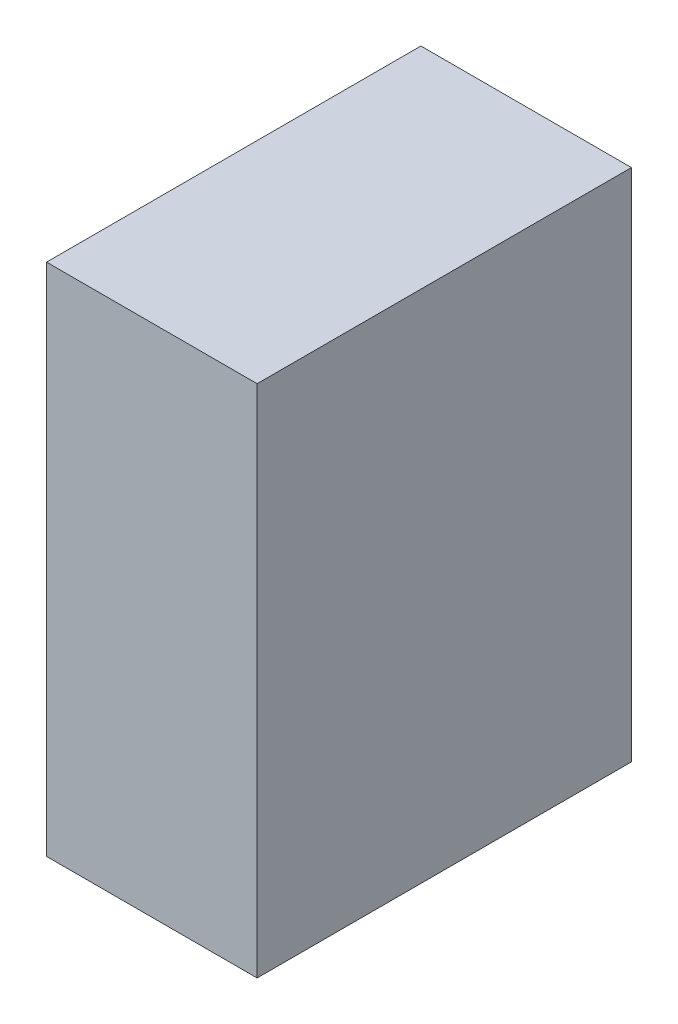
ISO-10303-21;
HEADER;
FILE_DESCRIPTION(('STEP AP214'),'2;1');
FILE_NAME('part.step','',(''),(''),'','','');
FILE_SCHEMA(('AUTOMOTIVE_DESIGN { 1 0 10303 214 1 1 1 1 }'));
ENDSEC;
DATA;
#1=APPLICATION_CONTEXT('core data for automotive mechanical design processes');
#2=APPLICATION_PROTOCOL_DEFINITION('international standard','automotive_design',2000,#1);
#3=PRODUCT_CONTEXT('',#1,'mechanical');
#4=PRODUCT('Part','Part','',(#3));
#5=PRODUCT_RELATED_PRODUCT_CATEGORY('part','',(#4));
#6=PRODUCT_DEFINITION_FORMATION('','',#4);
#7=PRODUCT_DEFINITION_CONTEXT('part definition',#1,'design');
#8=PRODUCT_DEFINITION('design','',#6,#7);
#9=PRODUCT_DEFINITION_SHAPE('','',#8);
#10=(LENGTH_UNIT() NAMED_UNIT(*) SI_UNIT(.MILLI.,.METRE.));
#11=(NAMED_UNIT(*) PLANE_ANGLE_UNIT() SI_UNIT($,.RADIAN.));
#12=(NAMED_UNIT(*) SI_UNIT($,.STERADIAN.) SOLID_ANGLE_UNIT());
#13=UNCERTAINTY_MEASURE_WITH_UNIT(LENGTH_MEASURE(1.E-05),#10,'distance_accuracy_value','');
#14=(GEOMETRIC_REPRESENTATION_CONTEXT(3) GLOBAL_UNCERTAINTY_ASSIGNED_CONTEXT((#13)) GLOBAL_UNIT_ASSIGNED_CONTEXT((#10,
#11,#12)) REPRESENTATION_CONTEXT('',''));
#15=CARTESIAN_POINT('',(0.,0.,0.));
#16=DIRECTION('',(0.,0.,1.));
#17=DIRECTION('',(1.,0.,0.));
#18=AXIS2_PLACEMENT_3D('',#15,#16,#17);
#19=CARTESIAN_POINT('',(0.11249914,0.27500072,0.));
#20=DIRECTION('',(1.,0.,0.));
#21=DIRECTION('',(0.,0.,-1.));
#22=AXIS2_PLACEMENT_3D('',#19,#20,#21);
#23=PLANE('',#22);
#24=DIRECTION('',(0.,0.,-1.));
#25=VECTOR('',#24,1.);
#26=CARTESIAN_POINT('',(0.11249914,-0.27500072,0.));
#27=LINE('',#26,#25);
#28=CARTESIAN_POINT('',(0.11249914,-0.27500072,0.));
#29=VERTEX_POINT('',#28);
#30=CARTESIAN_POINT('',(0.11249914,-0.27500072,0.3999992));
#31=VERTEX_POINT('',#30);
#32=EDGE_CURVE('E20',#29,#31,#27,.F.);
#33=ORIENTED_EDGE('',*,*,#32,.F.);
#34=DIRECTION('',(0.,1.,0.));
#35=VECTOR('',#34,1.);
#36=CARTESIAN_POINT('',(0.11249914,-0.27500072,0.));
#37=LINE('',#36,#35);
#38=CARTESIAN_POINT('',(0.11249914,0.27500072,0.));
#39=VERTEX_POINT('',#38);
#40=EDGE_CURVE('E80',#29,#39,#37,.T.);
#41=ORIENTED_EDGE('',*,*,#40,.T.);
#42=DIRECTION('',(0.,0.,1.));
#43=VECTOR('',#42,1.);
#44=CARTESIAN_POINT('',(0.11249914,0.27500072,0.));
#45=LINE('',#44,#43);
#46=CARTESIAN_POINT('',(0.11249914,0.27500072,0.3999992));
#47=VERTEX_POINT('',#46);
#48=EDGE_CURVE('E68',#47,#39,#45,.F.);
#49=ORIENTED_EDGE('',*,*,#48,.F.);
#50=DIRECTION('',(0.,1.,0.));
#51=VECTOR('',#50,1.);
#52=CARTESIAN_POINT('',(0.11249914,-0.27500072,0.3999992));
#53=LINE('',#52,#51);
#54=EDGE_CURVE('E56',#31,#47,#53,.T.);
#55=ORIENTED_EDGE('',*,*,#54,.F.);
#56=EDGE_LOOP('',(#33,#41,#49,#55));
#57=FACE_BOUND('',#56,.T.);
#58=ADVANCED_FACE('F17',(#57),#23,.T.);
#59=CARTESIAN_POINT('',(0.11249914,-0.27500072,0.));
#60=DIRECTION('',(0.,-1.,0.));
#61=DIRECTION('',(0.,0.,-1.));
#62=AXIS2_PLACEMENT_3D('',#59,#60,#61);
#63=PLANE('',#62);
#64=DIRECTION('',(0.,0.,1.));
#65=VECTOR('',#64,1.);
#66=CARTESIAN_POINT('',(-0.11249914,-0.27500072,0.));
#67=LINE('',#66,#65);
#68=CARTESIAN_POINT('',(-0.11249914,-0.27500072,0.));
#69=VERTEX_POINT('',#68);
#70=CARTESIAN_POINT('',(-0.11249914,-0.27500072,0.3999992));
#71=VERTEX_POINT('',#70);
#72=EDGE_CURVE('E83',#69,#71,#67,.T.);
#73=ORIENTED_EDGE('',*,*,#72,.F.);
#74=DIRECTION('',(1.,0.,0.));
#75=VECTOR('',#74,1.);
#76=CARTESIAN_POINT('',(-0.11249914,-0.27500072,0.));
#77=LINE('',#76,#75);
#78=EDGE_CURVE('E65',#69,#29,#77,.T.);
#79=ORIENTED_EDGE('',*,*,#78,.T.);
#80=ORIENTED_EDGE('',*,*,#32,.T.);
#81=DIRECTION('',(1.,0.,0.));
#82=VECTOR('',#81,1.);
#83=CARTESIAN_POINT('',(-0.11249914,-0.27500072,0.3999992));
#84=LINE('',#83,#82);
#85=EDGE_CURVE('E62',#71,#31,#84,.T.);
#86=ORIENTED_EDGE('',*,*,#85,.F.);
#87=EDGE_LOOP('',(#73,#79,#80,#86));
#88=FACE_BOUND('',#87,.T.);
#89=ADVANCED_FACE('F61',(#88),#63,.T.);
#90=CARTESIAN_POINT('',(-0.11249914,-0.27500072,0.3999992));
#91=DIRECTION('',(0.,0.,1.));
#92=DIRECTION('',(1.,0.,0.));
#93=AXIS2_PLACEMENT_3D('',#90,#91,#92);
#94=PLANE('',#93);
#95=DIRECTION('',(1.,0.,0.));
#96=VECTOR('',#95,1.);
#97=CARTESIAN_POINT('',(-0.11249914,0.27500072,0.3999992));
#98=LINE('',#97,#96);
#99=CARTESIAN_POINT('',(-0.11249914,0.27500072,0.3999992));
#100=VERTEX_POINT('',#99);
#101=EDGE_CURVE('E70',#100,#47,#98,.T.);
#102=ORIENTED_EDGE('',*,*,#101,.F.);
#103=DIRECTION('',(0.,1.,0.));
#104=VECTOR('',#103,1.);
#105=CARTESIAN_POINT('',(-0.11249914,-0.27500072,0.3999992));
#106=LINE('',#105,#104);
#107=EDGE_CURVE('E74',#71,#100,#106,.T.);
#108=ORIENTED_EDGE('',*,*,#107,.F.);
#109=ORIENTED_EDGE('',*,*,#85,.T.);
#110=ORIENTED_EDGE('',*,*,#54,.T.);
#111=EDGE_LOOP('',(#102,#108,#109,#110));
#112=FACE_BOUND('',#111,.T.);
#113=ADVANCED_FACE('F72',(#112),#94,.T.);
#114=CARTESIAN_POINT('',(-0.11249914,0.27500072,0.));
#115=DIRECTION('',(0.,1.,0.));
#116=DIRECTION('',(0.,0.,1.));
#117=AXIS2_PLACEMENT_3D('',#114,#115,#116);
#118=PLANE('',#117);
#119=ORIENTED_EDGE('',*,*,#48,.T.);
#120=DIRECTION('',(1.,0.,0.));
#121=VECTOR('',#120,1.);
#122=CARTESIAN_POINT('',(-0.11249914,0.27500072,0.));
#123=LINE('',#122,#121);
#124=CARTESIAN_POINT('',(-0.11249914,0.27500072,0.));
#125=VERTEX_POINT('',#124);
#126=EDGE_CURVE('E35',#39,#125,#123,.F.);
#127=ORIENTED_EDGE('',*,*,#126,.T.);
#128=DIRECTION('',(0.,0.,1.));
#129=VECTOR('',#128,1.);
#130=CARTESIAN_POINT('',(-0.11249914,0.27500072,0.));
#131=LINE('',#130,#129);
#132=EDGE_CURVE('E26',#100,#125,#131,.F.);
#133=ORIENTED_EDGE('',*,*,#132,.F.);
#134=ORIENTED_EDGE('',*,*,#101,.T.);
#135=EDGE_LOOP('',(#119,#127,#133,#134));
#136=FACE_BOUND('',#135,.T.);
#137=ADVANCED_FACE('F89',(#136),#118,.T.);
#138=CARTESIAN_POINT('',(-0.11249914,-0.27500072,0.));
#139=DIRECTION('',(0.,0.,1.));
#140=DIRECTION('',(1.,0.,0.));
#141=AXIS2_PLACEMENT_3D('',#138,#139,#140);
#142=PLANE('',#141);
#143=ORIENTED_EDGE('',*,*,#126,.F.);
#144=ORIENTED_EDGE('',*,*,#40,.F.);
#145=ORIENTED_EDGE('',*,*,#78,.F.);
#146=DIRECTION('',(0.,1.,0.));
#147=VECTOR('',#146,1.);
#148=CARTESIAN_POINT('',(-0.11249914,-0.27500072,0.));
#149=LINE('',#148,#147);
#150=EDGE_CURVE('E11',#125,#69,#149,.F.);
#151=ORIENTED_EDGE('',*,*,#150,.F.);
#152=EDGE_LOOP('',(#143,#144,#145,#151));
#153=FACE_BOUND('',#152,.T.);
#154=ADVANCED_FACE('F91',(#153),#142,.F.);
#155=CARTESIAN_POINT('',(-0.11249914,-0.27500072,0.));
#156=DIRECTION('',(-1.,0.,0.));
#157=DIRECTION('',(0.,0.,1.));
#158=AXIS2_PLACEMENT_3D('',#155,#156,#157);
#159=PLANE('',#158);
#160=ORIENTED_EDGE('',*,*,#132,.T.);
#161=ORIENTED_EDGE('',*,*,#150,.T.);
#162=ORIENTED_EDGE('',*,*,#72,.T.);
#163=ORIENTED_EDGE('',*,*,#107,.T.);
#164=EDGE_LOOP('',(#160,#161,#162,#163));
#165=FACE_BOUND('',#164,.T.);
#166=ADVANCED_FACE('F88',(#165),#159,.T.);
#167=CLOSED_SHELL('',(#58,#89,#113,#137,#154,#166));
#168=MANIFOLD_SOLID_BREP('B1',#167);
#169=ADVANCED_BREP_SHAPE_REPRESENTATION('',(#18,#168),#14);
#170=SHAPE_DEFINITION_REPRESENTATION(#9,#169);
ENDSEC;
END-ISO-10303-21;
